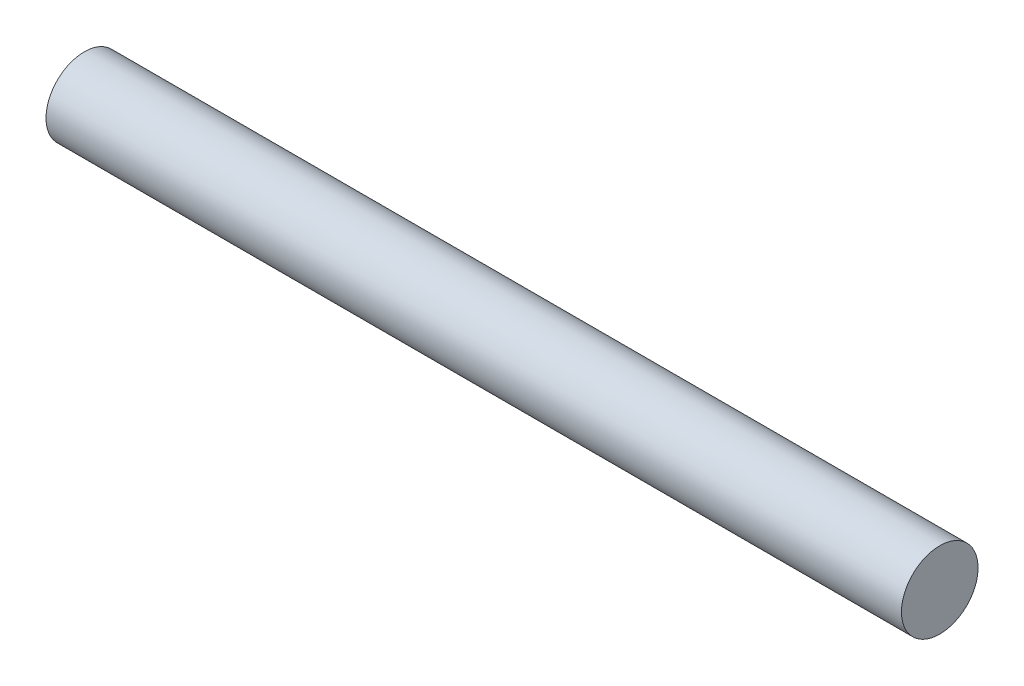
ISO-10303-21;
HEADER;
FILE_DESCRIPTION(('STEP AP214'),'2;1');
FILE_NAME('part.step','',(''),(''),'','','');
FILE_SCHEMA(('AUTOMOTIVE_DESIGN { 1 0 10303 214 1 1 1 1 }'));
ENDSEC;
DATA;
#1=APPLICATION_CONTEXT('core data for automotive mechanical design processes');
#2=APPLICATION_PROTOCOL_DEFINITION('international standard','automotive_design',2000,#1);
#3=PRODUCT_CONTEXT('',#1,'mechanical');
#4=PRODUCT('Part','Part','',(#3));
#5=PRODUCT_RELATED_PRODUCT_CATEGORY('part','',(#4));
#6=PRODUCT_DEFINITION_FORMATION('','',#4);
#7=PRODUCT_DEFINITION_CONTEXT('part definition',#1,'design');
#8=PRODUCT_DEFINITION('design','',#6,#7);
#9=PRODUCT_DEFINITION_SHAPE('','',#8);
#10=(LENGTH_UNIT() NAMED_UNIT(*) SI_UNIT(.MILLI.,.METRE.));
#11=(NAMED_UNIT(*) PLANE_ANGLE_UNIT() SI_UNIT($,.RADIAN.));
#12=(NAMED_UNIT(*) SI_UNIT($,.STERADIAN.) SOLID_ANGLE_UNIT());
#13=UNCERTAINTY_MEASURE_WITH_UNIT(LENGTH_MEASURE(1.E-05),#10,'distance_accuracy_value','');
#14=(GEOMETRIC_REPRESENTATION_CONTEXT(3) GLOBAL_UNCERTAINTY_ASSIGNED_CONTEXT((#13)) GLOBAL_UNIT_ASSIGNED_CONTEXT((#10,
#11,#12)) REPRESENTATION_CONTEXT('',''));
#15=CARTESIAN_POINT('',(0.,0.,0.));
#16=DIRECTION('',(0.,0.,1.));
#17=DIRECTION('',(1.,0.,0.));
#18=AXIS2_PLACEMENT_3D('',#15,#16,#17);
#19=CARTESIAN_POINT('',(0.,0.,0.));
#20=DIRECTION('',(-1.,0.,0.));
#21=DIRECTION('',(0.,0.,1.));
#22=AXIS2_PLACEMENT_3D('',#19,#20,#21);
#23=CYLINDRICAL_SURFACE('',#22,3.);
#24=CARTESIAN_POINT('',(33.5,0.,0.));
#25=DIRECTION('',(-1.,0.,0.));
#26=DIRECTION('',(0.,0.,1.));
#27=AXIS2_PLACEMENT_3D('',#24,#25,#26);
#28=CIRCLE('',#27,3.);
#29=CARTESIAN_POINT('',(33.5,0.,3.));
#30=VERTEX_POINT('',#29);
#31=EDGE_CURVE('E10',#30,#30,#28,.T.);
#32=ORIENTED_EDGE('',*,*,#31,.T.);
#33=EDGE_LOOP('',(#32));
#34=FACE_BOUND('',#33,.T.);
#35=CARTESIAN_POINT('',(-33.5,0.,0.));
#36=DIRECTION('',(-1.,0.,0.));
#37=DIRECTION('',(0.,0.,1.));
#38=AXIS2_PLACEMENT_3D('',#35,#36,#37);
#39=CIRCLE('',#38,3.);
#40=CARTESIAN_POINT('',(-33.5,0.,3.));
#41=VERTEX_POINT('',#40);
#42=EDGE_CURVE('E43',#41,#41,#39,.T.);
#43=ORIENTED_EDGE('',*,*,#42,.F.);
#44=EDGE_LOOP('',(#43));
#45=FACE_BOUND('',#44,.T.);
#46=ADVANCED_FACE('F37',(#34,#45),#23,.T.);
#47=CARTESIAN_POINT('',(33.5,3.,0.));
#48=DIRECTION('',(-1.,0.,0.));
#49=DIRECTION('',(0.,0.,1.));
#50=AXIS2_PLACEMENT_3D('',#47,#48,#49);
#51=PLANE('',#50);
#52=ORIENTED_EDGE('',*,*,#31,.F.);
#53=EDGE_LOOP('',(#52));
#54=FACE_BOUND('',#53,.T.);
#55=ADVANCED_FACE('F52',(#54),#51,.F.);
#56=CARTESIAN_POINT('',(-33.5,3.,0.));
#57=DIRECTION('',(1.,0.,0.));
#58=DIRECTION('',(0.,0.,1.));
#59=AXIS2_PLACEMENT_3D('',#56,#57,#58);
#60=PLANE('',#59);
#61=ORIENTED_EDGE('',*,*,#42,.T.);
#62=EDGE_LOOP('',(#61));
#63=FACE_BOUND('',#62,.T.);
#64=ADVANCED_FACE('F49',(#63),#60,.F.);
#65=CLOSED_SHELL('',(#46,#55,#64));
#66=MANIFOLD_SOLID_BREP('B2',#65);
#67=ADVANCED_BREP_SHAPE_REPRESENTATION('',(#18,#66),#14);
#68=SHAPE_DEFINITION_REPRESENTATION(#9,#67);
ENDSEC;
END-ISO-10303-21;
